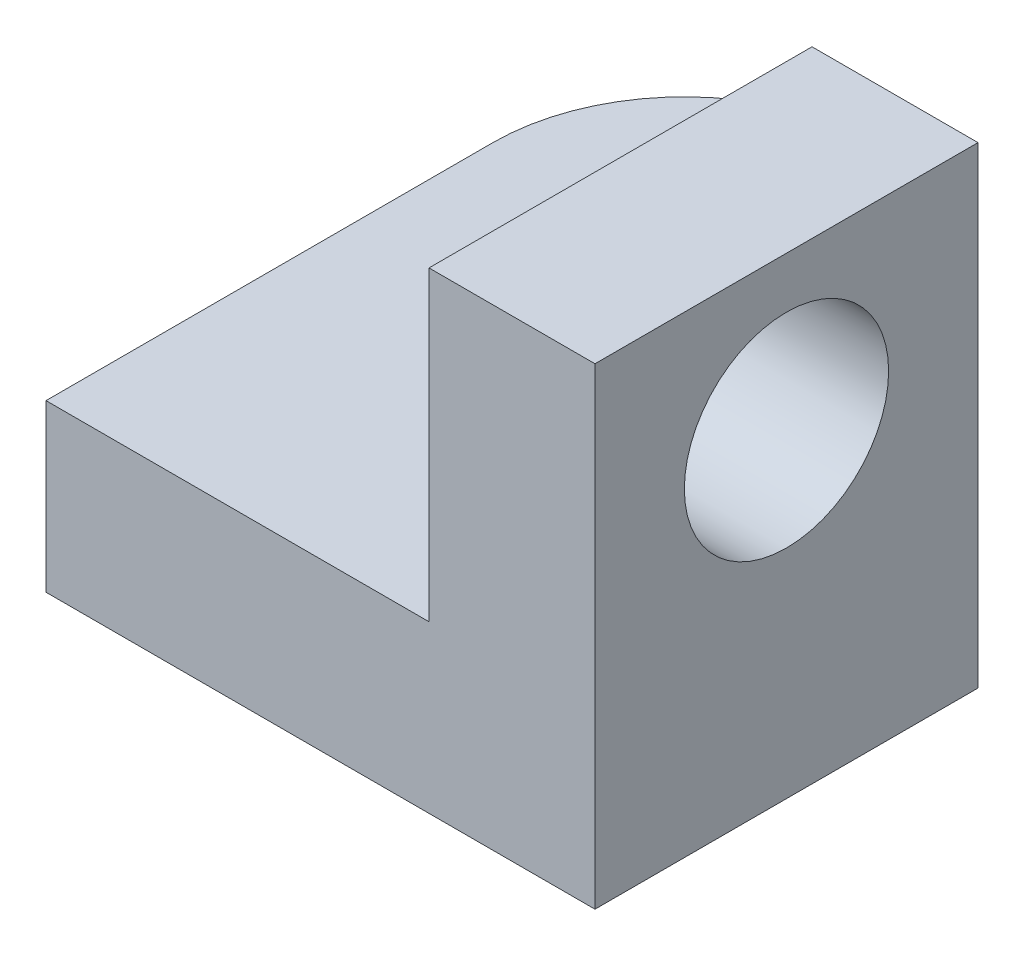
ISO-10303-21;
HEADER;
FILE_DESCRIPTION(('STEP AP214'),'2;1');
FILE_NAME('part.step','',(''),(''),'','','');
FILE_SCHEMA(('AUTOMOTIVE_DESIGN { 1 0 10303 214 1 1 1 1 }'));
ENDSEC;
DATA;
#1=APPLICATION_CONTEXT('core data for automotive mechanical design processes');
#2=APPLICATION_PROTOCOL_DEFINITION('international standard','automotive_design',2000,#1);
#3=PRODUCT_CONTEXT('',#1,'mechanical');
#4=PRODUCT('Part','Part','',(#3));
#5=PRODUCT_RELATED_PRODUCT_CATEGORY('part','',(#4));
#6=PRODUCT_DEFINITION_FORMATION('','',#4);
#7=PRODUCT_DEFINITION_CONTEXT('part definition',#1,'design');
#8=PRODUCT_DEFINITION('design','',#6,#7);
#9=PRODUCT_DEFINITION_SHAPE('','',#8);
#10=(LENGTH_UNIT() NAMED_UNIT(*) SI_UNIT(.MILLI.,.METRE.));
#11=(NAMED_UNIT(*) PLANE_ANGLE_UNIT() SI_UNIT($,.RADIAN.));
#12=(NAMED_UNIT(*) SI_UNIT($,.STERADIAN.) SOLID_ANGLE_UNIT());
#13=UNCERTAINTY_MEASURE_WITH_UNIT(LENGTH_MEASURE(1.E-05),#10,'distance_accuracy_value','');
#14=(GEOMETRIC_REPRESENTATION_CONTEXT(3) GLOBAL_UNCERTAINTY_ASSIGNED_CONTEXT((#13)) GLOBAL_UNIT_ASSIGNED_CONTEXT((#10,
#11,#12)) REPRESENTATION_CONTEXT('',''));
#15=CARTESIAN_POINT('',(0.,0.,0.));
#16=DIRECTION('',(0.,0.,1.));
#17=DIRECTION('',(1.,0.,0.));
#18=AXIS2_PLACEMENT_3D('',#15,#16,#17);
#19=CARTESIAN_POINT('',(19.9019607843137,13.,5.63725490196079));
#20=DIRECTION('',(-1.,0.,0.));
#21=DIRECTION('',(0.,0.,1.));
#22=AXIS2_PLACEMENT_3D('',#19,#20,#21);
#23=PLANE('',#22);
#24=DIRECTION('',(0.,1.,0.));
#25=VECTOR('',#24,1.);
#26=CARTESIAN_POINT('',(19.9019607843137,13.,-24.3627450980392));
#27=LINE('',#26,#25);
#28=CARTESIAN_POINT('',(19.9019607843137,0.,-24.3627450980392));
#29=VERTEX_POINT('',#28);
#30=CARTESIAN_POINT('',(19.9019607843137,13.,-24.3627450980392));
#31=VERTEX_POINT('',#30);
#32=EDGE_CURVE('E11',#29,#31,#27,.T.);
#33=ORIENTED_EDGE('',*,*,#32,.F.);
#34=DIRECTION('',(0.,0.,-1.));
#35=VECTOR('',#34,1.);
#36=CARTESIAN_POINT('',(19.9019607843137,0.,5.63725490196079));
#37=LINE('',#36,#35);
#38=CARTESIAN_POINT('',(19.9019607843137,0.,-29.3627450980392));
#39=VERTEX_POINT('',#38);
#40=EDGE_CURVE('E134',#29,#39,#37,.T.);
#41=ORIENTED_EDGE('',*,*,#40,.T.);
#42=DIRECTION('',(0.,-1.,0.));
#43=VECTOR('',#42,1.);
#44=CARTESIAN_POINT('',(19.9019607843137,13.,-29.3627450980392));
#45=LINE('',#44,#43);
#46=CARTESIAN_POINT('',(19.9019607843137,13.,-29.3627450980392));
#47=VERTEX_POINT('',#46);
#48=EDGE_CURVE('E182',#47,#39,#45,.T.);
#49=ORIENTED_EDGE('',*,*,#48,.F.);
#50=DIRECTION('',(0.,0.,-1.));
#51=VECTOR('',#50,1.);
#52=CARTESIAN_POINT('',(19.9019607843137,13.,5.63725490196079));
#53=LINE('',#52,#51);
#54=EDGE_CURVE('E162',#31,#47,#53,.T.);
#55=ORIENTED_EDGE('',*,*,#54,.F.);
#56=EDGE_LOOP('',(#33,#41,#49,#55));
#57=FACE_BOUND('',#56,.T.);
#58=ADVANCED_FACE('F43',(#57),#23,.F.);
#59=CARTESIAN_POINT('',(4.90196078431372,13.,-29.3627450980392));
#60=DIRECTION('',(0.,-1.,0.));
#61=DIRECTION('',(0.,0.,-1.));
#62=AXIS2_PLACEMENT_3D('',#59,#60,#61);
#63=PLANE('',#62);
#64=DIRECTION('',(1.,0.,0.));
#65=VECTOR('',#64,1.);
#66=CARTESIAN_POINT('',(-10.0980392156863,13.,5.63725490196079));
#67=LINE('',#66,#65);
#68=CARTESIAN_POINT('',(-10.0980392156863,13.,5.63725490196079));
#69=VERTEX_POINT('',#68);
#70=CARTESIAN_POINT('',(19.9,13.,5.63725490196079));
#71=VERTEX_POINT('',#70);
#72=EDGE_CURVE('E64',#69,#71,#67,.T.);
#73=ORIENTED_EDGE('',*,*,#72,.T.);
#74=DIRECTION('',(0.,0.,-1.));
#75=VECTOR('',#74,1.);
#76=CARTESIAN_POINT('',(19.9,13.,-29.3627450980392));
#77=LINE('',#76,#75);
#78=CARTESIAN_POINT('',(19.9,13.,-24.3627450980392));
#79=VERTEX_POINT('',#78);
#80=EDGE_CURVE('E59',#71,#79,#77,.T.);
#81=ORIENTED_EDGE('',*,*,#80,.T.);
#82=DIRECTION('',(-1.,0.,0.));
#83=VECTOR('',#82,1.);
#84=CARTESIAN_POINT('',(4.90196078431372,13.,-24.3627450980392));
#85=LINE('',#84,#83);
#86=EDGE_CURVE('E136',#31,#79,#85,.T.);
#87=ORIENTED_EDGE('',*,*,#86,.F.);
#88=ORIENTED_EDGE('',*,*,#54,.T.);
#89=CARTESIAN_POINT('',(4.90196078431372,13.,-29.3627450980392));
#90=DIRECTION('',(0.,1.,0.));
#91=DIRECTION('',(0.,0.,-1.));
#92=AXIS2_PLACEMENT_3D('',#89,#90,#91);
#93=CIRCLE('',#92,15.);
#94=CARTESIAN_POINT('',(-10.0980392156863,13.,-29.3627450980392));
#95=VERTEX_POINT('',#94);
#96=EDGE_CURVE('E165',#47,#95,#93,.T.);
#97=ORIENTED_EDGE('',*,*,#96,.T.);
#98=DIRECTION('',(0.,0.,1.));
#99=VECTOR('',#98,1.);
#100=CARTESIAN_POINT('',(-10.0980392156863,13.,-29.3627450980392));
#101=LINE('',#100,#99);
#102=EDGE_CURVE('E156',#95,#69,#101,.T.);
#103=ORIENTED_EDGE('',*,*,#102,.T.);
#104=EDGE_LOOP('',(#73,#81,#87,#88,#97,#103));
#105=FACE_BOUND('',#104,.T.);
#106=CARTESIAN_POINT('',(4.90196078431372,13.,-29.3627450980392));
#107=DIRECTION('',(0.,1.,0.));
#108=DIRECTION('',(0.,0.,1.));
#109=AXIS2_PLACEMENT_3D('',#106,#107,#108);
#110=CIRCLE('',#109,6.5);
#111=CARTESIAN_POINT('',(4.90196078431372,13.,-22.8627450980392));
#112=VERTEX_POINT('',#111);
#113=EDGE_CURVE('E148',#112,#112,#110,.T.);
#114=ORIENTED_EDGE('',*,*,#113,.F.);
#115=EDGE_LOOP('',(#114));
#116=FACE_BOUND('',#115,.T.);
#117=ADVANCED_FACE('F244',(#105,#116),#63,.F.);
#118=CARTESIAN_POINT('',(4.90196078431372,0.,-29.3627450980392));
#119=DIRECTION('',(0.,-1.,0.));
#120=DIRECTION('',(0.,0.,-1.));
#121=AXIS2_PLACEMENT_3D('',#118,#119,#120);
#122=PLANE('',#121);
#123=DIRECTION('',(0.,0.,-1.));
#124=VECTOR('',#123,1.);
#125=CARTESIAN_POINT('',(32.9,0.,5.63725490196079));
#126=LINE('',#125,#124);
#127=CARTESIAN_POINT('',(32.9,0.,5.63725490196079));
#128=VERTEX_POINT('',#127);
#129=CARTESIAN_POINT('',(32.9,0.,-24.3627450980392));
#130=VERTEX_POINT('',#129);
#131=EDGE_CURVE('E118',#128,#130,#126,.T.);
#132=ORIENTED_EDGE('',*,*,#131,.F.);
#133=DIRECTION('',(1.,0.,0.));
#134=VECTOR('',#133,1.);
#135=CARTESIAN_POINT('',(-10.0980392156863,0.,5.63725490196079));
#136=LINE('',#135,#134);
#137=CARTESIAN_POINT('',(-10.0980392156863,0.,5.63725490196079));
#138=VERTEX_POINT('',#137);
#139=EDGE_CURVE('E172',#138,#128,#136,.T.);
#140=ORIENTED_EDGE('',*,*,#139,.F.);
#141=DIRECTION('',(0.,0.,1.));
#142=VECTOR('',#141,1.);
#143=CARTESIAN_POINT('',(-10.0980392156863,0.,-29.3627450980392));
#144=LINE('',#143,#142);
#145=CARTESIAN_POINT('',(-10.0980392156863,0.,-29.3627450980392));
#146=VERTEX_POINT('',#145);
#147=EDGE_CURVE('E152',#146,#138,#144,.T.);
#148=ORIENTED_EDGE('',*,*,#147,.F.);
#149=CARTESIAN_POINT('',(4.90196078431372,0.,-29.3627450980392));
#150=DIRECTION('',(0.,1.,0.));
#151=DIRECTION('',(0.,0.,-1.));
#152=AXIS2_PLACEMENT_3D('',#149,#150,#151);
#153=CIRCLE('',#152,15.);
#154=EDGE_CURVE('E159',#39,#146,#153,.T.);
#155=ORIENTED_EDGE('',*,*,#154,.F.);
#156=ORIENTED_EDGE('',*,*,#40,.F.);
#157=DIRECTION('',(-1.,0.,0.));
#158=VECTOR('',#157,1.);
#159=CARTESIAN_POINT('',(32.9,0.,-24.3627450980392));
#160=LINE('',#159,#158);
#161=EDGE_CURVE('E111',#130,#29,#160,.T.);
#162=ORIENTED_EDGE('',*,*,#161,.F.);
#163=EDGE_LOOP('',(#132,#140,#148,#155,#156,#162));
#164=FACE_BOUND('',#163,.T.);
#165=CARTESIAN_POINT('',(4.90196078431372,0.,-29.3627450980392));
#166=DIRECTION('',(0.,1.,0.));
#167=DIRECTION('',(0.,0.,1.));
#168=AXIS2_PLACEMENT_3D('',#165,#166,#167);
#169=CIRCLE('',#168,6.5);
#170=CARTESIAN_POINT('',(4.90196078431372,0.,-22.8627450980392));
#171=VERTEX_POINT('',#170);
#172=EDGE_CURVE('E147',#171,#171,#169,.T.);
#173=ORIENTED_EDGE('',*,*,#172,.T.);
#174=EDGE_LOOP('',(#173));
#175=FACE_BOUND('',#174,.T.);
#176=ADVANCED_FACE('F131',(#164,#175),#122,.T.);
#177=CARTESIAN_POINT('',(-10.0980392156863,13.,-29.3627450980392));
#178=DIRECTION('',(1.,0.,0.));
#179=DIRECTION('',(0.,0.,-1.));
#180=AXIS2_PLACEMENT_3D('',#177,#178,#179);
#181=PLANE('',#180);
#182=ORIENTED_EDGE('',*,*,#147,.T.);
#183=DIRECTION('',(0.,-1.,0.));
#184=VECTOR('',#183,1.);
#185=CARTESIAN_POINT('',(-10.0980392156863,13.,5.63725490196079));
#186=LINE('',#185,#184);
#187=EDGE_CURVE('E52',#69,#138,#186,.T.);
#188=ORIENTED_EDGE('',*,*,#187,.F.);
#189=ORIENTED_EDGE('',*,*,#102,.F.);
#190=DIRECTION('',(0.,-1.,0.));
#191=VECTOR('',#190,1.);
#192=CARTESIAN_POINT('',(-10.0980392156863,13.,-29.3627450980392));
#193=LINE('',#192,#191);
#194=EDGE_CURVE('E168',#95,#146,#193,.T.);
#195=ORIENTED_EDGE('',*,*,#194,.T.);
#196=EDGE_LOOP('',(#182,#188,#189,#195));
#197=FACE_BOUND('',#196,.T.);
#198=ADVANCED_FACE('F45',(#197),#181,.F.);
#199=CARTESIAN_POINT('',(-10.0980392156863,13.,5.63725490196079));
#200=DIRECTION('',(0.,0.,-1.));
#201=DIRECTION('',(-1.,0.,0.));
#202=AXIS2_PLACEMENT_3D('',#199,#200,#201);
#203=PLANE('',#202);
#204=ORIENTED_EDGE('',*,*,#139,.T.);
#205=DIRECTION('',(0.,-1.,0.));
#206=VECTOR('',#205,1.);
#207=CARTESIAN_POINT('',(32.9,0.,5.63725490196079));
#208=LINE('',#207,#206);
#209=CARTESIAN_POINT('',(32.9,37.,5.63725490196079));
#210=VERTEX_POINT('',#209);
#211=EDGE_CURVE('E125',#210,#128,#208,.T.);
#212=ORIENTED_EDGE('',*,*,#211,.F.);
#213=DIRECTION('',(-1.,0.,0.));
#214=VECTOR('',#213,1.);
#215=CARTESIAN_POINT('',(32.9,37.,5.63725490196079));
#216=LINE('',#215,#214);
#217=CARTESIAN_POINT('',(19.9,37.,5.63725490196079));
#218=VERTEX_POINT('',#217);
#219=EDGE_CURVE('E141',#210,#218,#216,.T.);
#220=ORIENTED_EDGE('',*,*,#219,.T.);
#221=DIRECTION('',(0.,-1.,0.));
#222=VECTOR('',#221,1.);
#223=CARTESIAN_POINT('',(19.9,0.,5.63725490196079));
#224=LINE('',#223,#222);
#225=EDGE_CURVE('E128',#218,#71,#224,.T.);
#226=ORIENTED_EDGE('',*,*,#225,.T.);
#227=ORIENTED_EDGE('',*,*,#72,.F.);
#228=ORIENTED_EDGE('',*,*,#187,.T.);
#229=EDGE_LOOP('',(#204,#212,#220,#226,#227,#228));
#230=FACE_BOUND('',#229,.T.);
#231=ADVANCED_FACE('F189',(#230),#203,.F.);
#232=CARTESIAN_POINT('',(4.90196078431372,13.,-29.3627450980392));
#233=DIRECTION('',(0.,-1.,0.));
#234=DIRECTION('',(0.,0.,-1.));
#235=AXIS2_PLACEMENT_3D('',#232,#233,#234);
#236=CYLINDRICAL_SURFACE('',#235,15.);
#237=ORIENTED_EDGE('',*,*,#154,.T.);
#238=ORIENTED_EDGE('',*,*,#194,.F.);
#239=ORIENTED_EDGE('',*,*,#96,.F.);
#240=ORIENTED_EDGE('',*,*,#48,.T.);
#241=EDGE_LOOP('',(#237,#238,#239,#240));
#242=FACE_BOUND('',#241,.T.);
#243=ADVANCED_FACE('F196',(#242),#236,.T.);
#244=CARTESIAN_POINT('',(4.90196078431372,13.,-29.3627450980392));
#245=DIRECTION('',(0.,-1.,0.));
#246=DIRECTION('',(0.,0.,-1.));
#247=AXIS2_PLACEMENT_3D('',#244,#245,#246);
#248=CYLINDRICAL_SURFACE('',#247,6.5);
#249=ORIENTED_EDGE('',*,*,#113,.T.);
#250=EDGE_LOOP('',(#249));
#251=FACE_BOUND('',#250,.T.);
#252=ORIENTED_EDGE('',*,*,#172,.F.);
#253=EDGE_LOOP('',(#252));
#254=FACE_BOUND('',#253,.T.);
#255=ADVANCED_FACE('F257',(#251,#254),#248,.F.);
#256=CARTESIAN_POINT('',(19.9,0.,0.));
#257=DIRECTION('',(-1.,0.,0.));
#258=DIRECTION('',(0.,0.,1.));
#259=AXIS2_PLACEMENT_3D('',#256,#257,#258);
#260=PLANE('',#259);
#261=CARTESIAN_POINT('',(19.9,25.,-9.36274509803921));
#262=DIRECTION('',(1.,0.,0.));
#263=DIRECTION('',(0.,0.,-1.));
#264=AXIS2_PLACEMENT_3D('',#261,#262,#263);
#265=CIRCLE('',#264,8.);
#266=CARTESIAN_POINT('',(19.9,25.,-17.3627450980392));
#267=VERTEX_POINT('',#266);
#268=EDGE_CURVE('E215',#267,#267,#265,.T.);
#269=ORIENTED_EDGE('',*,*,#268,.T.);
#270=EDGE_LOOP('',(#269));
#271=FACE_BOUND('',#270,.T.);
#272=ORIENTED_EDGE('',*,*,#80,.F.);
#273=ORIENTED_EDGE('',*,*,#225,.F.);
#274=DIRECTION('',(0.,0.,1.));
#275=VECTOR('',#274,1.);
#276=CARTESIAN_POINT('',(19.9,37.,5.63725490196079));
#277=LINE('',#276,#275);
#278=CARTESIAN_POINT('',(19.9,37.,-24.3627450980392));
#279=VERTEX_POINT('',#278);
#280=EDGE_CURVE('E207',#279,#218,#277,.T.);
#281=ORIENTED_EDGE('',*,*,#280,.F.);
#282=DIRECTION('',(0.,1.,0.));
#283=VECTOR('',#282,1.);
#284=CARTESIAN_POINT('',(19.9,37.,-24.3627450980392));
#285=LINE('',#284,#283);
#286=EDGE_CURVE('E202',#79,#279,#285,.T.);
#287=ORIENTED_EDGE('',*,*,#286,.F.);
#288=EDGE_LOOP('',(#272,#273,#281,#287));
#289=FACE_BOUND('',#288,.T.);
#290=ADVANCED_FACE('F205',(#271,#289),#260,.T.);
#291=CARTESIAN_POINT('',(32.9,37.,-24.3627450980392));
#292=DIRECTION('',(0.,0.,1.));
#293=DIRECTION('',(1.,0.,0.));
#294=AXIS2_PLACEMENT_3D('',#291,#292,#293);
#295=PLANE('',#294);
#296=ORIENTED_EDGE('',*,*,#32,.T.);
#297=ORIENTED_EDGE('',*,*,#86,.T.);
#298=ORIENTED_EDGE('',*,*,#286,.T.);
#299=DIRECTION('',(-1.,0.,0.));
#300=VECTOR('',#299,1.);
#301=CARTESIAN_POINT('',(32.9,37.,-24.3627450980392));
#302=LINE('',#301,#300);
#303=CARTESIAN_POINT('',(32.9,37.,-24.3627450980392));
#304=VERTEX_POINT('',#303);
#305=EDGE_CURVE('E113',#304,#279,#302,.T.);
#306=ORIENTED_EDGE('',*,*,#305,.F.);
#307=DIRECTION('',(0.,1.,0.));
#308=VECTOR('',#307,1.);
#309=CARTESIAN_POINT('',(32.9,37.,-24.3627450980392));
#310=LINE('',#309,#308);
#311=EDGE_CURVE('E107',#130,#304,#310,.T.);
#312=ORIENTED_EDGE('',*,*,#311,.F.);
#313=ORIENTED_EDGE('',*,*,#161,.T.);
#314=EDGE_LOOP('',(#296,#297,#298,#306,#312,#313));
#315=FACE_BOUND('',#314,.T.);
#316=ADVANCED_FACE('F109',(#315),#295,.F.);
#317=CARTESIAN_POINT('',(32.9,0.,0.));
#318=DIRECTION('',(-1.,0.,0.));
#319=DIRECTION('',(0.,0.,1.));
#320=AXIS2_PLACEMENT_3D('',#317,#318,#319);
#321=PLANE('',#320);
#322=ORIENTED_EDGE('',*,*,#131,.T.);
#323=ORIENTED_EDGE('',*,*,#311,.T.);
#324=DIRECTION('',(0.,0.,1.));
#325=VECTOR('',#324,1.);
#326=CARTESIAN_POINT('',(32.9,37.,5.63725490196079));
#327=LINE('',#326,#325);
#328=EDGE_CURVE('E117',#304,#210,#327,.T.);
#329=ORIENTED_EDGE('',*,*,#328,.T.);
#330=ORIENTED_EDGE('',*,*,#211,.T.);
#331=EDGE_LOOP('',(#322,#323,#329,#330));
#332=FACE_BOUND('',#331,.T.);
#333=CARTESIAN_POINT('',(32.9,25.,-9.36274509803921));
#334=DIRECTION('',(1.,0.,0.));
#335=DIRECTION('',(0.,0.,-1.));
#336=AXIS2_PLACEMENT_3D('',#333,#334,#335);
#337=CIRCLE('',#336,8.);
#338=CARTESIAN_POINT('',(32.9,25.,-17.3627450980392));
#339=VERTEX_POINT('',#338);
#340=EDGE_CURVE('E209',#339,#339,#337,.T.);
#341=ORIENTED_EDGE('',*,*,#340,.F.);
#342=EDGE_LOOP('',(#341));
#343=FACE_BOUND('',#342,.T.);
#344=ADVANCED_FACE('F122',(#332,#343),#321,.F.);
#345=CARTESIAN_POINT('',(32.9,37.,5.63725490196079));
#346=DIRECTION('',(0.,-1.,0.));
#347=DIRECTION('',(0.,0.,-1.));
#348=AXIS2_PLACEMENT_3D('',#345,#346,#347);
#349=PLANE('',#348);
#350=ORIENTED_EDGE('',*,*,#280,.T.);
#351=ORIENTED_EDGE('',*,*,#219,.F.);
#352=ORIENTED_EDGE('',*,*,#328,.F.);
#353=ORIENTED_EDGE('',*,*,#305,.T.);
#354=EDGE_LOOP('',(#350,#351,#352,#353));
#355=FACE_BOUND('',#354,.T.);
#356=ADVANCED_FACE('F234',(#355),#349,.F.);
#357=CARTESIAN_POINT('',(32.9,25.,-9.36274509803921));
#358=DIRECTION('',(-1.,0.,0.));
#359=DIRECTION('',(0.,0.,1.));
#360=AXIS2_PLACEMENT_3D('',#357,#358,#359);
#361=CYLINDRICAL_SURFACE('',#360,8.);
#362=ORIENTED_EDGE('',*,*,#340,.T.);
#363=EDGE_LOOP('',(#362));
#364=FACE_BOUND('',#363,.T.);
#365=ORIENTED_EDGE('',*,*,#268,.F.);
#366=EDGE_LOOP('',(#365));
#367=FACE_BOUND('',#366,.T.);
#368=ADVANCED_FACE('F232',(#364,#367),#361,.F.);
#369=CLOSED_SHELL('',(#58,#117,#176,#198,#231,#243,#255,#290,#316,#344,#356,#368));
#370=MANIFOLD_SOLID_BREP('B2',#369);
#371=ADVANCED_BREP_SHAPE_REPRESENTATION('',(#18,#370),#14);
#372=SHAPE_DEFINITION_REPRESENTATION(#9,#371);
ENDSEC;
END-ISO-10303-21;
